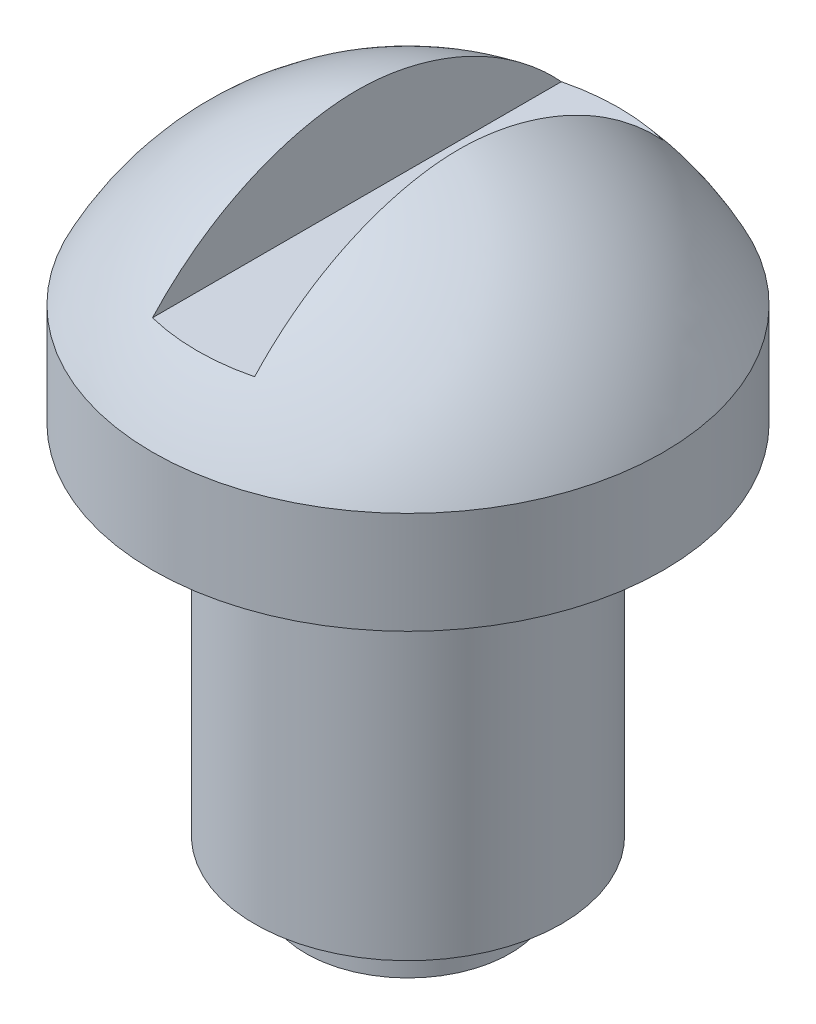
ISO-10303-21;
HEADER;
FILE_DESCRIPTION(('STEP AP214'),'2;1');
FILE_NAME('part.step','',(''),(''),'','','');
FILE_SCHEMA(('AUTOMOTIVE_DESIGN { 1 0 10303 214 1 1 1 1 }'));
ENDSEC;
DATA;
#1=APPLICATION_CONTEXT('core data for automotive mechanical design processes');
#2=APPLICATION_PROTOCOL_DEFINITION('international standard','automotive_design',2000,#1);
#3=PRODUCT_CONTEXT('',#1,'mechanical');
#4=PRODUCT('Part','Part','',(#3));
#5=PRODUCT_RELATED_PRODUCT_CATEGORY('part','',(#4));
#6=PRODUCT_DEFINITION_FORMATION('','',#4);
#7=PRODUCT_DEFINITION_CONTEXT('part definition',#1,'design');
#8=PRODUCT_DEFINITION('design','',#6,#7);
#9=PRODUCT_DEFINITION_SHAPE('','',#8);
#10=(LENGTH_UNIT() NAMED_UNIT(*) SI_UNIT(.MILLI.,.METRE.));
#11=(NAMED_UNIT(*) PLANE_ANGLE_UNIT() SI_UNIT($,.RADIAN.));
#12=(NAMED_UNIT(*) SI_UNIT($,.STERADIAN.) SOLID_ANGLE_UNIT());
#13=UNCERTAINTY_MEASURE_WITH_UNIT(LENGTH_MEASURE(1.E-05),#10,'distance_accuracy_value','');
#14=(GEOMETRIC_REPRESENTATION_CONTEXT(3) GLOBAL_UNCERTAINTY_ASSIGNED_CONTEXT((#13)) GLOBAL_UNIT_ASSIGNED_CONTEXT((#10,
#11,#12)) REPRESENTATION_CONTEXT('',''));
#15=CARTESIAN_POINT('',(0.,0.,0.));
#16=DIRECTION('',(0.,0.,1.));
#17=DIRECTION('',(1.,0.,0.));
#18=AXIS2_PLACEMENT_3D('',#15,#16,#17);
#19=CARTESIAN_POINT('',(0.,0.,0.));
#20=DIRECTION('',(0.,1.,0.));
#21=DIRECTION('',(-1.,0.,0.));
#22=AXIS2_PLACEMENT_3D('',#19,#20,#21);
#23=PLANE('',#22);
#24=CARTESIAN_POINT('',(0.,0.,0.));
#25=DIRECTION('',(0.,1.,0.));
#26=DIRECTION('',(-1.,0.,0.));
#27=AXIS2_PLACEMENT_3D('',#24,#25,#26);
#28=CIRCLE('',#27,2.);
#29=CARTESIAN_POINT('',(-2.,0.,0.));
#30=VERTEX_POINT('',#29);
#31=EDGE_CURVE('E76',#30,#30,#28,.T.);
#32=ORIENTED_EDGE('',*,*,#31,.F.);
#33=EDGE_LOOP('',(#32));
#34=FACE_BOUND('',#33,.T.);
#35=ADVANCED_FACE('F33',(#34),#23,.F.);
#36=CARTESIAN_POINT('',(0.,13.2834795938306,0.));
#37=DIRECTION('',(0.,1.,0.));
#38=DIRECTION('',(-1.,0.,0.));
#39=AXIS2_PLACEMENT_3D('',#36,#37,#38);
#40=CYLINDRICAL_SURFACE('',#39,2.);
#41=CARTESIAN_POINT('',(0.,1.,0.));
#42=DIRECTION('',(0.,1.,0.));
#43=DIRECTION('',(-1.,0.,0.));
#44=AXIS2_PLACEMENT_3D('',#41,#42,#43);
#45=CIRCLE('',#44,2.);
#46=CARTESIAN_POINT('',(-2.,1.,0.));
#47=VERTEX_POINT('',#46);
#48=EDGE_CURVE('E105',#47,#47,#45,.T.);
#49=ORIENTED_EDGE('',*,*,#48,.F.);
#50=EDGE_LOOP('',(#49));
#51=FACE_BOUND('',#50,.T.);
#52=ORIENTED_EDGE('',*,*,#31,.T.);
#53=EDGE_LOOP('',(#52));
#54=FACE_BOUND('',#53,.T.);
#55=ADVANCED_FACE('F95',(#51,#54),#40,.T.);
#56=CARTESIAN_POINT('',(2.,1.,0.));
#57=DIRECTION('',(0.,1.,0.));
#58=DIRECTION('',(-1.,0.,0.));
#59=AXIS2_PLACEMENT_3D('',#56,#57,#58);
#60=PLANE('',#59);
#61=CARTESIAN_POINT('',(0.,1.,0.));
#62=DIRECTION('',(0.,1.,0.));
#63=DIRECTION('',(-1.,0.,0.));
#64=AXIS2_PLACEMENT_3D('',#61,#62,#63);
#65=CIRCLE('',#64,3.);
#66=CARTESIAN_POINT('',(-3.,1.,0.));
#67=VERTEX_POINT('',#66);
#68=EDGE_CURVE('E107',#67,#67,#65,.T.);
#69=ORIENTED_EDGE('',*,*,#68,.F.);
#70=EDGE_LOOP('',(#69));
#71=FACE_BOUND('',#70,.T.);
#72=ORIENTED_EDGE('',*,*,#48,.T.);
#73=EDGE_LOOP('',(#72));
#74=FACE_BOUND('',#73,.T.);
#75=ADVANCED_FACE('F100',(#71,#74),#60,.F.);
#76=CARTESIAN_POINT('',(0.,13.2834795938306,0.));
#77=DIRECTION('',(0.,1.,0.));
#78=DIRECTION('',(-1.,0.,0.));
#79=AXIS2_PLACEMENT_3D('',#76,#77,#78);
#80=CYLINDRICAL_SURFACE('',#79,3.);
#81=CARTESIAN_POINT('',(0.,8.,0.));
#82=DIRECTION('',(0.,1.,0.));
#83=DIRECTION('',(-1.,0.,0.));
#84=AXIS2_PLACEMENT_3D('',#81,#82,#83);
#85=CIRCLE('',#84,3.);
#86=CARTESIAN_POINT('',(-3.,8.,0.));
#87=VERTEX_POINT('',#86);
#88=EDGE_CURVE('E112',#87,#87,#85,.T.);
#89=ORIENTED_EDGE('',*,*,#88,.F.);
#90=EDGE_LOOP('',(#89));
#91=FACE_BOUND('',#90,.T.);
#92=ORIENTED_EDGE('',*,*,#68,.T.);
#93=EDGE_LOOP('',(#92));
#94=FACE_BOUND('',#93,.T.);
#95=ADVANCED_FACE('F129',(#91,#94),#80,.T.);
#96=CARTESIAN_POINT('',(3.,8.,0.));
#97=DIRECTION('',(0.,1.,0.));
#98=DIRECTION('',(-1.,0.,0.));
#99=AXIS2_PLACEMENT_3D('',#96,#97,#98);
#100=PLANE('',#99);
#101=CARTESIAN_POINT('',(0.,8.,0.));
#102=DIRECTION('',(0.,1.,0.));
#103=DIRECTION('',(-1.,0.,0.));
#104=AXIS2_PLACEMENT_3D('',#101,#102,#103);
#105=CIRCLE('',#104,5.);
#106=CARTESIAN_POINT('',(-5.,8.,0.));
#107=VERTEX_POINT('',#106);
#108=EDGE_CURVE('E115',#107,#107,#105,.T.);
#109=ORIENTED_EDGE('',*,*,#108,.F.);
#110=EDGE_LOOP('',(#109));
#111=FACE_BOUND('',#110,.T.);
#112=ORIENTED_EDGE('',*,*,#88,.T.);
#113=EDGE_LOOP('',(#112));
#114=FACE_BOUND('',#113,.T.);
#115=ADVANCED_FACE('F124',(#111,#114),#100,.F.);
#116=CARTESIAN_POINT('',(0.,13.2834795938306,0.));
#117=DIRECTION('',(0.,1.,0.));
#118=DIRECTION('',(-1.,0.,0.));
#119=AXIS2_PLACEMENT_3D('',#116,#117,#118);
#120=CYLINDRICAL_SURFACE('',#119,5.);
#121=CARTESIAN_POINT('',(0.,10.,0.));
#122=DIRECTION('',(0.,1.,0.));
#123=DIRECTION('',(-1.,0.,0.));
#124=AXIS2_PLACEMENT_3D('',#121,#122,#123);
#125=CIRCLE('',#124,5.);
#126=CARTESIAN_POINT('',(-5.,10.,0.));
#127=VERTEX_POINT('',#126);
#128=EDGE_CURVE('E72',#127,#127,#125,.T.);
#129=ORIENTED_EDGE('',*,*,#128,.F.);
#130=EDGE_LOOP('',(#129));
#131=FACE_BOUND('',#130,.T.);
#132=ORIENTED_EDGE('',*,*,#108,.T.);
#133=EDGE_LOOP('',(#132));
#134=FACE_BOUND('',#133,.T.);
#135=ADVANCED_FACE('F93',(#131,#134),#120,.T.);
#136=CARTESIAN_POINT('',(0.,7.29399938463264,0.));
#137=DIRECTION('',(0.,1.,0.));
#138=DIRECTION('',(-1.,0.,0.));
#139=AXIS2_PLACEMENT_3D('',#136,#137,#138);
#140=DEGENERATE_TOROIDAL_SURFACE('',#139,0.355143384600591,6.,.F.);
#141=CARTESIAN_POINT('',(1.,13.1389618658786,0.));
#142=CARTESIAN_POINT('',(1.,13.1389603919835,0.0850328425565637));
#143=CARTESIAN_POINT('',(1.,13.1364344246599,0.170070660451229));
#144=CARTESIAN_POINT('',(1.,13.1264695741514,0.339867655967292));
#145=CARTESIAN_POINT('',(1.,13.1190296841498,0.424626772908076));
#146=CARTESIAN_POINT('',(1.,13.0995356908146,0.593773379398525));
#147=CARTESIAN_POINT('',(1.,13.087472811866,0.678159851505433));
#148=CARTESIAN_POINT('',(1.,13.0590506359627,0.846205859484286));
#149=CARTESIAN_POINT('',(1.,13.0426907916764,0.929865301346359));
#150=CARTESIAN_POINT('',(1.,12.9907346277812,1.16507832985906));
#151=CARTESIAN_POINT('',(1.,12.9504130760353,1.31561409344176));
#152=CARTESIAN_POINT('',(1.,12.8573184172411,1.61277558515722));
#153=CARTESIAN_POINT('',(1.,12.8045399922619,1.75939961350334));
#154=CARTESIAN_POINT('',(1.,12.6284124182625,2.19227184737322));
#155=CARTESIAN_POINT('',(1.,12.4872740009543,2.47150689425713));
#156=CARTESIAN_POINT('',(1.,12.159427444758,3.00854414756779));
#157=CARTESIAN_POINT('',(1.,11.9719430926804,3.26586877813439));
#158=CARTESIAN_POINT('',(1.,11.5579922369121,3.74683266680831));
#159=CARTESIAN_POINT('',(1.,11.3315404059199,3.97048454473703));
#160=CARTESIAN_POINT('',(1.,10.8358623499102,4.38661861875134));
#161=CARTESIAN_POINT('',(1.,10.5652878411453,4.57749691876385));
#162=CARTESIAN_POINT('',(1.,9.99599766263568,4.91141635871516));
#163=CARTESIAN_POINT('',(1.,9.69727470078855,5.05444505888901));
#164=CARTESIAN_POINT('',(1.,9.07865799600566,5.2891840472589));
#165=CARTESIAN_POINT('',(1.,8.75866978276463,5.38064547974962));
#166=CARTESIAN_POINT('',(1.,8.10791277321656,5.50860683714735));
#167=CARTESIAN_POINT('',(1.,7.77714471936667,5.54511053910701));
#168=CARTESIAN_POINT('',(1.,7.11380400338354,5.56215193085177));
#169=CARTESIAN_POINT('',(1.,6.78122975667972,5.54262802786194));
#170=CARTESIAN_POINT('',(1.,6.12404465851391,5.44802697595133));
#171=CARTESIAN_POINT('',(1.,5.79943460785946,5.37294426399918));
#172=CARTESIAN_POINT('',(1.,5.16737468168114,5.1693183789964));
#173=CARTESIAN_POINT('',(1.,4.85992779016648,5.04076594225955));
#174=CARTESIAN_POINT('',(1.,4.27108573493106,4.73387108362165));
#175=CARTESIAN_POINT('',(1.,3.98968356254225,4.55554210883003));
#176=CARTESIAN_POINT('',(1.,3.46112918902706,4.15428608792663));
#177=CARTESIAN_POINT('',(1.,3.21394331949111,3.9314034177033));
#178=CARTESIAN_POINT('',(1.,2.76047791286786,3.44707038672561));
#179=CARTESIAN_POINT('',(1.,2.55422754858956,3.18559275090249));
#180=CARTESIAN_POINT('',(1.,2.1894726993251,2.63214183958189));
#181=CARTESIAN_POINT('',(1.,2.03082144103085,2.34026612711448));
#182=CARTESIAN_POINT('',(1.,1.83230109435047,1.8856908368542));
#183=CARTESIAN_POINT('',(1.,1.77269561312684,1.73133895856993));
#184=CARTESIAN_POINT('',(1.,1.66732944982305,1.41800863715458));
#185=CARTESIAN_POINT('',(1.,1.62156043400984,1.2590330424092));
#186=CARTESIAN_POINT('',(1.,1.55271793148878,0.97015369465858));
#187=CARTESIAN_POINT('',(1.,1.5269241406722,0.840892765526842));
#188=CARTESIAN_POINT('',(1.,1.4857282674408,0.58074918979322));
#189=CARTESIAN_POINT('',(1.,1.47032142747817,0.449867313649059));
#190=CARTESIAN_POINT('',(1.,1.45117033213037,0.187464266725036));
#191=CARTESIAN_POINT('',(1.,1.44740489724965,0.0559446934391722));
#192=CARTESIAN_POINT('',(1.,1.4519891912672,-0.206893805210199));
#193=CARTESIAN_POINT('',(1.,1.46034067683506,-0.338212698716693));
#194=CARTESIAN_POINT('',(1.,1.48810939798059,-0.599163943765945));
#195=CARTESIAN_POINT('',(1.,1.50748683125071,-0.728800655445434));
#196=CARTESIAN_POINT('',(1.,1.5561212707663,-0.986202867987158));
#197=CARTESIAN_POINT('',(1.,1.58537966971374,-1.11396810241833));
#198=CARTESIAN_POINT('',(1.,1.65312354708426,-1.36737350224881));
#199=CARTESIAN_POINT('',(1.,1.6916322411765,-1.49300745556586));
#200=CARTESIAN_POINT('',(1.,1.77732126189906,-1.74123809249285));
#201=CARTESIAN_POINT('',(1.,1.82450114085274,-1.86383493253249));
#202=CARTESIAN_POINT('',(1.,1.99243147634959,-2.25908094925751));
#203=CARTESIAN_POINT('',(1.,2.13053184924552,-2.52460098745995));
#204=CARTESIAN_POINT('',(1.,2.44536340466876,-3.03104874238679));
#205=CARTESIAN_POINT('',(1.,2.6220581944685,-3.27199931509947));
#206=CARTESIAN_POINT('',(1.,3.02904381970867,-3.74660836934393));
#207=CARTESIAN_POINT('',(1.,3.26289129213469,-3.97723468013999));
#208=CARTESIAN_POINT('',(1.,3.76574235644802,-4.39660845475862));
#209=CARTESIAN_POINT('',(1.,4.03477033071908,-4.58532662646686));
#210=CARTESIAN_POINT('',(1.,4.60354948807616,-4.91739742845414));
#211=CARTESIAN_POINT('',(1.,4.9036086604776,-5.06022303173989));
#212=CARTESIAN_POINT('',(1.,5.52335617016387,-5.29357187265148));
#213=CARTESIAN_POINT('',(1.,5.8430414863261,-5.38410313791064));
#214=CARTESIAN_POINT('',(1.,6.49381637470259,-5.51051170896944));
#215=CARTESIAN_POINT('',(1.,6.82493072479348,-5.54626150446674));
#216=CARTESIAN_POINT('',(1.,7.48847275019264,-5.56169447174759));
#217=CARTESIAN_POINT('',(1.,7.82090046723166,-5.54137584747924));
#218=CARTESIAN_POINT('',(1.,8.47777884413847,-5.445220666461));
#219=CARTESIAN_POINT('',(1.,8.80222590359157,-5.36935951026516));
#220=CARTESIAN_POINT('',(1.,9.43379618967364,-5.16422276508375));
#221=CARTESIAN_POINT('',(1.,9.74091825660864,-5.03494360523394));
#222=CARTESIAN_POINT('',(1.,10.3290191795942,-4.72665039340705));
#223=CARTESIAN_POINT('',(1.,10.6100028716363,-4.5476455659519));
#224=CARTESIAN_POINT('',(1.,11.1377998747752,-4.14497018018803));
#225=CARTESIAN_POINT('',(1.,11.3846228494897,-3.92131229755071));
#226=CARTESIAN_POINT('',(1.,11.8365894661061,-3.43613582912001));
#227=CARTESIAN_POINT('',(1.,12.0418144306335,-3.1746928608352));
#228=CARTESIAN_POINT('',(1.,12.4054008914517,-2.62035407646978));
#229=CARTESIAN_POINT('',(1.,12.5637135254302,-2.3274258960404));
#230=CARTESIAN_POINT('',(1.,12.7526571763881,-1.89165831000316));
#231=CARTESIAN_POINT('',(1.,12.8048097914375,-1.75781482121982));
#232=CARTESIAN_POINT('',(1.,12.89876610149,-1.48646197326711));
#233=CARTESIAN_POINT('',(1.,12.9405676445138,-1.34895185838021));
#234=CARTESIAN_POINT('',(1.,13.0130135265239,-1.0715118452414));
#235=CARTESIAN_POINT('',(1.,13.0436942611277,-0.931591439565383));
#236=CARTESIAN_POINT('',(1.,13.093031749279,-0.649702165294844));
#237=CARTESIAN_POINT('',(1.,13.1116987632068,-0.507735150861897));
#238=CARTESIAN_POINT('',(1.,13.1286796408662,-0.304492896103027));
#239=CARTESIAN_POINT('',(1.,13.1325261992823,-0.243650762732366));
#240=CARTESIAN_POINT('',(1.,13.1376674684358,-0.121873249758503));
#241=CARTESIAN_POINT('',(1.,13.1389629221302,-0.0609379024772165));
#242=CARTESIAN_POINT('',(1.,13.1389618658786,0.));
#243=B_SPLINE_CURVE_WITH_KNOTS('',3,(#141,#142,#143,#144,#145,#146,#147,#148,#149,#150,#151,
#152,#153,#154,#155,#156,#157,#158,#159,#160,#161,#162,#163,#164,#165,#166,#167,#168,#169,#170,
#171,#172,#173,#174,#175,#176,#177,#178,#179,#180,#181,#182,#183,#184,#185,#186,#187,#188,#189,
#190,#191,#192,#193,#194,#195,#196,#197,#198,#199,#200,#201,#202,#203,#204,#205,#206,#207,#208,
#209,#210,#211,#212,#213,#214,#215,#216,#217,#218,#219,#220,#221,#222,#223,#224,#225,#226,#227,
#228,#229,#230,#231,#232,#233,#234,#235,#236,#237,#238,#239,#240,#241,#242),.UNSPECIFIED.,.T.,
.F.,(4,2,2,2,2,2,2,2,2,2,2,2,2,2,2,2,2,2,2,2,2,2,2,2,2,2,2,2,2,2,2,2,2,2,2,2,2,2,2,2,2,2,2,2,2,
2,2,2,2,2,4),(0.,0.255071021588062,0.510194321054442,0.76580432793682,1.02144690928111,
1.48832134712622,1.95539545877336,2.88958413841847,3.84062714488441,4.79131282891856,
5.78001171242867,6.76896743489489,7.76265572882096,8.7562757269068,9.75098845864987,
10.7458008031664,11.7407855718084,12.7355018054777,13.7292321853782,14.7236682272114,
15.7150056121808,16.2108764320282,16.7064479900263,17.1015138495826,17.496398633478,
17.890564569703,18.2847876564645,18.6775965938879,19.0704609200538,19.4643217217308,
19.8581621948389,20.7520803656567,21.6451592247433,22.6258164179018,23.6071569087712,
24.599394586521,25.591479906696,26.5858709330101,27.5802938132383,28.57515738387,
29.570087469485,30.564833110467,31.5592967732864,32.5517971348978,33.5453276471172,
33.9759464214681,34.4066546460911,34.8359402644389,35.2648587609327,35.4477060148284,
35.6305000103127),.UNSPECIFIED.);
#244=CARTESIAN_POINT('',(1.,11.2834795938306,-4.00337458275441));
#245=VERTEX_POINT('',#244);
#246=CARTESIAN_POINT('',(1.,11.2834795938306,4.00337458275441));
#247=VERTEX_POINT('',#246);
#248=EDGE_CURVE('E70',#245,#247,#243,.T.);
#249=ORIENTED_EDGE('',*,*,#248,.T.);
#250=CARTESIAN_POINT('',(0.,11.2834795938306,0.));
#251=DIRECTION('',(0.,-1.,0.));
#252=DIRECTION('',(0.,0.,-1.));
#253=AXIS2_PLACEMENT_3D('',#250,#251,#252);
#254=CIRCLE('',#253,4.12637953293732);
#255=CARTESIAN_POINT('',(-1.,11.2834795938306,4.00337458275441));
#256=VERTEX_POINT('',#255);
#257=EDGE_CURVE('E11',#247,#256,#254,.T.);
#258=ORIENTED_EDGE('',*,*,#257,.T.);
#259=CARTESIAN_POINT('',(-1.,13.1389618658786,0.));
#260=CARTESIAN_POINT('',(-1.,13.1389603919835,-0.0850328425565638));
#261=CARTESIAN_POINT('',(-1.,13.1364344246599,-0.170070660451229));
#262=CARTESIAN_POINT('',(-1.,13.1264695741514,-0.339867655967292));
#263=CARTESIAN_POINT('',(-1.,13.1190296841498,-0.424626772908076));
#264=CARTESIAN_POINT('',(-1.,13.0995356908146,-0.593773379398526));
#265=CARTESIAN_POINT('',(-1.,13.087472811866,-0.678159851505434));
#266=CARTESIAN_POINT('',(-1.,13.0590506359627,-0.846205859484287));
#267=CARTESIAN_POINT('',(-1.,13.0426907916764,-0.92986530134636));
#268=CARTESIAN_POINT('',(-1.,12.9907346277812,-1.16507832985906));
#269=CARTESIAN_POINT('',(-1.,12.9504130760353,-1.31561409344176));
#270=CARTESIAN_POINT('',(-1.,12.8573184172411,-1.61277558515722));
#271=CARTESIAN_POINT('',(-1.,12.8045399922619,-1.75939961350334));
#272=CARTESIAN_POINT('',(-1.,12.6284124182625,-2.19227184737322));
#273=CARTESIAN_POINT('',(-1.,12.4872740009543,-2.47150689425713));
#274=CARTESIAN_POINT('',(-1.,12.159427444758,-3.00854414756779));
#275=CARTESIAN_POINT('',(-1.,11.9719430926804,-3.26586877813439));
#276=CARTESIAN_POINT('',(-1.,11.5579922369121,-3.74683266680831));
#277=CARTESIAN_POINT('',(-1.,11.3315404059199,-3.97048454473703));
#278=CARTESIAN_POINT('',(-1.,10.8358623499102,-4.38661861875134));
#279=CARTESIAN_POINT('',(-1.,10.5652878411453,-4.57749691876385));
#280=CARTESIAN_POINT('',(-1.,9.99599766263568,-4.91141635871516));
#281=CARTESIAN_POINT('',(-1.,9.69727470078854,-5.05444505888901));
#282=CARTESIAN_POINT('',(-1.,9.07865799600566,-5.2891840472589));
#283=CARTESIAN_POINT('',(-1.,8.75866978276463,-5.38064547974962));
#284=CARTESIAN_POINT('',(-1.,8.10791277321656,-5.50860683714735));
#285=CARTESIAN_POINT('',(-1.,7.77714471936667,-5.54511053910701));
#286=CARTESIAN_POINT('',(-1.,7.11380400338354,-5.56215193085177));
#287=CARTESIAN_POINT('',(-1.,6.78122975667972,-5.54262802786194));
#288=CARTESIAN_POINT('',(-1.,6.12404465851391,-5.44802697595133));
#289=CARTESIAN_POINT('',(-1.,5.79943460785946,-5.37294426399918));
#290=CARTESIAN_POINT('',(-1.,5.16737468168114,-5.1693183789964));
#291=CARTESIAN_POINT('',(-1.,4.85992779016648,-5.04076594225955));
#292=CARTESIAN_POINT('',(-1.,4.27108573493106,-4.73387108362165));
#293=CARTESIAN_POINT('',(-1.,3.98968356254225,-4.55554210883003));
#294=CARTESIAN_POINT('',(-1.,3.46112918902706,-4.15428608792663));
#295=CARTESIAN_POINT('',(-1.,3.21394331949111,-3.9314034177033));
#296=CARTESIAN_POINT('',(-1.,2.76047791286786,-3.44707038672561));
#297=CARTESIAN_POINT('',(-1.,2.55422754858956,-3.18559275090249));
#298=CARTESIAN_POINT('',(-1.,2.1894726993251,-2.63214183958188));
#299=CARTESIAN_POINT('',(-1.,2.03082144103085,-2.34026612711448));
#300=CARTESIAN_POINT('',(-1.,1.83230109435047,-1.8856908368542));
#301=CARTESIAN_POINT('',(-1.,1.77269561312684,-1.73133895856993));
#302=CARTESIAN_POINT('',(-1.,1.66732944982305,-1.41800863715458));
#303=CARTESIAN_POINT('',(-1.,1.62156043400984,-1.2590330424092));
#304=CARTESIAN_POINT('',(-1.,1.55271793148878,-0.97015369465858));
#305=CARTESIAN_POINT('',(-1.,1.5269241406722,-0.840892765526841));
#306=CARTESIAN_POINT('',(-1.,1.4857282674408,-0.580749189793219));
#307=CARTESIAN_POINT('',(-1.,1.47032142747817,-0.449867313649058));
#308=CARTESIAN_POINT('',(-1.,1.45117033213037,-0.187464266725036));
#309=CARTESIAN_POINT('',(-1.,1.44740489724965,-0.0559446934391736));
#310=CARTESIAN_POINT('',(-1.,1.45198919126721,0.206893805210197));
#311=CARTESIAN_POINT('',(-1.,1.46034067683506,0.338212698716693));
#312=CARTESIAN_POINT('',(-1.,1.48810939798059,0.599163943765946));
#313=CARTESIAN_POINT('',(-1.,1.50748683125071,0.728800655445433));
#314=CARTESIAN_POINT('',(-1.,1.5561212707663,0.986202867987156));
#315=CARTESIAN_POINT('',(-1.,1.58537966971374,1.11396810241833));
#316=CARTESIAN_POINT('',(-1.,1.65312354708426,1.36737350224881));
#317=CARTESIAN_POINT('',(-1.,1.6916322411765,1.49300745556586));
#318=CARTESIAN_POINT('',(-1.,1.77732126189906,1.74123809249285));
#319=CARTESIAN_POINT('',(-1.,1.82450114085274,1.86383493253249));
#320=CARTESIAN_POINT('',(-1.,1.99243147634959,2.25908094925751));
#321=CARTESIAN_POINT('',(-1.,2.13053184924552,2.52460098745995));
#322=CARTESIAN_POINT('',(-1.,2.44536340466876,3.0310487423868));
#323=CARTESIAN_POINT('',(-1.,2.6220581944685,3.27199931509947));
#324=CARTESIAN_POINT('',(-1.,3.02904381970867,3.74660836934393));
#325=CARTESIAN_POINT('',(-1.,3.26289129213469,3.97723468013999));
#326=CARTESIAN_POINT('',(-1.,3.76574235644802,4.39660845475862));
#327=CARTESIAN_POINT('',(-1.,4.03477033071909,4.58532662646686));
#328=CARTESIAN_POINT('',(-1.,4.60354948807616,4.91739742845414));
#329=CARTESIAN_POINT('',(-1.,4.9036086604776,5.0602230317399));
#330=CARTESIAN_POINT('',(-1.,5.52335617016387,5.29357187265148));
#331=CARTESIAN_POINT('',(-1.,5.8430414863261,5.38410313791064));
#332=CARTESIAN_POINT('',(-1.,6.49381637470259,5.51051170896944));
#333=CARTESIAN_POINT('',(-1.,6.82493072479348,5.54626150446674));
#334=CARTESIAN_POINT('',(-1.,7.48847275019264,5.56169447174759));
#335=CARTESIAN_POINT('',(-1.,7.82090046723166,5.54137584747924));
#336=CARTESIAN_POINT('',(-1.,8.47777884413847,5.445220666461));
#337=CARTESIAN_POINT('',(-1.,8.80222590359157,5.36935951026516));
#338=CARTESIAN_POINT('',(-1.,9.43379618967364,5.16422276508375));
#339=CARTESIAN_POINT('',(-1.,9.74091825660864,5.03494360523394));
#340=CARTESIAN_POINT('',(-1.,10.3290191795942,4.72665039340705));
#341=CARTESIAN_POINT('',(-1.,10.6100028716363,4.5476455659519));
#342=CARTESIAN_POINT('',(-1.,11.1377998747752,4.14497018018803));
#343=CARTESIAN_POINT('',(-1.,11.3846228494897,3.92131229755071));
#344=CARTESIAN_POINT('',(-1.,11.8365894661061,3.43613582912001));
#345=CARTESIAN_POINT('',(-1.,12.0418144306335,3.1746928608352));
#346=CARTESIAN_POINT('',(-1.,12.4054008914517,2.62035407646978));
#347=CARTESIAN_POINT('',(-1.,12.5637135254302,2.3274258960404));
#348=CARTESIAN_POINT('',(-1.,12.7526571763881,1.89165831000316));
#349=CARTESIAN_POINT('',(-1.,12.8048097914375,1.75781482121982));
#350=CARTESIAN_POINT('',(-1.,12.89876610149,1.48646197326711));
#351=CARTESIAN_POINT('',(-1.,12.9405676445138,1.34895185838021));
#352=CARTESIAN_POINT('',(-1.,13.0130135265239,1.0715118452414));
#353=CARTESIAN_POINT('',(-1.,13.0436942611277,0.931591439565382));
#354=CARTESIAN_POINT('',(-1.,13.093031749279,0.649702165294843));
#355=CARTESIAN_POINT('',(-1.,13.1116987632068,0.507735150861896));
#356=CARTESIAN_POINT('',(-1.,13.1286796408662,0.304492896103025));
#357=CARTESIAN_POINT('',(-1.,13.1325261992823,0.243650762732361));
#358=CARTESIAN_POINT('',(-1.,13.1376674684358,0.121873249758498));
#359=CARTESIAN_POINT('',(-1.,13.1389629221302,0.0609379024772141));
#360=CARTESIAN_POINT('',(-1.,13.1389618658786,0.));
#361=B_SPLINE_CURVE_WITH_KNOTS('',3,(#259,#260,#261,#262,#263,#264,#265,#266,#267,#268,#269,
#270,#271,#272,#273,#274,#275,#276,#277,#278,#279,#280,#281,#282,#283,#284,#285,#286,#287,#288,
#289,#290,#291,#292,#293,#294,#295,#296,#297,#298,#299,#300,#301,#302,#303,#304,#305,#306,#307,
#308,#309,#310,#311,#312,#313,#314,#315,#316,#317,#318,#319,#320,#321,#322,#323,#324,#325,#326,
#327,#328,#329,#330,#331,#332,#333,#334,#335,#336,#337,#338,#339,#340,#341,#342,#343,#344,#345,
#346,#347,#348,#349,#350,#351,#352,#353,#354,#355,#356,#357,#358,#359,#360),.UNSPECIFIED.,.T.,
.F.,(4,2,2,2,2,2,2,2,2,2,2,2,2,2,2,2,2,2,2,2,2,2,2,2,2,2,2,2,2,2,2,2,2,2,2,2,2,2,2,2,2,2,2,2,2,
2,2,2,2,2,4),(0.,0.255071021588062,0.510194321054443,0.765804327936821,1.02144690928111,
1.48832134712622,1.95539545877337,2.88958413841847,3.84062714488442,4.79131282891856,
5.78001171242867,6.76896743489489,7.76265572882096,8.7562757269068,9.75098845864987,
10.7458008031664,11.7407855718084,12.7355018054777,13.7292321853782,14.7236682272114,
15.7150056121808,16.2108764320282,16.7064479900263,17.1015138495826,17.496398633478,
17.890564569703,18.2847876564645,18.6775965938879,19.0704609200538,19.4643217217308,
19.8581621948389,20.7520803656567,21.6451592247433,22.6258164179018,23.6071569087712,
24.599394586521,25.591479906696,26.5858709330101,27.5802938132383,28.57515738387,
29.5700874694849,30.5648331104669,31.5592967732864,32.5517971348978,33.5453276471172,
33.9759464214681,34.4066546460911,34.8359402644389,35.2648587609327,35.4477060148284,
35.6305000103127),.UNSPECIFIED.);
#362=CARTESIAN_POINT('',(-1.,11.2834795938306,-4.00337458275441));
#363=VERTEX_POINT('',#362);
#364=EDGE_CURVE('E36',#256,#363,#361,.T.);
#365=ORIENTED_EDGE('',*,*,#364,.T.);
#366=EDGE_CURVE('E46',#363,#245,#254,.T.);
#367=ORIENTED_EDGE('',*,*,#366,.T.);
#368=EDGE_LOOP('',(#249,#258,#365,#367));
#369=FACE_BOUND('',#368,.T.);
#370=ORIENTED_EDGE('',*,*,#128,.T.);
#371=EDGE_LOOP('',(#370));
#372=FACE_BOUND('',#371,.T.);
#373=ADVANCED_FACE('F74',(#369,#372),#140,.F.);
#374=CARTESIAN_POINT('',(-1.,11.2834795938306,-5.));
#375=DIRECTION('',(-1.,0.,0.));
#376=DIRECTION('',(0.,-1.,0.));
#377=AXIS2_PLACEMENT_3D('',#374,#375,#376);
#378=PLANE('',#377);
#379=DIRECTION('',(0.,0.,1.));
#380=VECTOR('',#379,1.);
#381=CARTESIAN_POINT('',(-1.,11.2834795938306,-5.));
#382=LINE('',#381,#380);
#383=EDGE_CURVE('E65',#363,#256,#382,.T.);
#384=ORIENTED_EDGE('',*,*,#383,.F.);
#385=ORIENTED_EDGE('',*,*,#364,.F.);
#386=EDGE_LOOP('',(#384,#385));
#387=FACE_BOUND('',#386,.T.);
#388=ADVANCED_FACE('F86',(#387),#378,.F.);
#389=CARTESIAN_POINT('',(1.,11.2834795938306,-5.));
#390=DIRECTION('',(1.,0.,0.));
#391=DIRECTION('',(0.,0.,-1.));
#392=AXIS2_PLACEMENT_3D('',#389,#390,#391);
#393=PLANE('',#392);
#394=DIRECTION('',(0.,0.,1.));
#395=VECTOR('',#394,1.);
#396=CARTESIAN_POINT('',(1.,11.2834795938306,-5.));
#397=LINE('',#396,#395);
#398=EDGE_CURVE('E53',#245,#247,#397,.T.);
#399=ORIENTED_EDGE('',*,*,#398,.T.);
#400=ORIENTED_EDGE('',*,*,#248,.F.);
#401=EDGE_LOOP('',(#399,#400));
#402=FACE_BOUND('',#401,.T.);
#403=ADVANCED_FACE('F69',(#402),#393,.F.);
#404=CARTESIAN_POINT('',(1.,11.2834795938306,-5.));
#405=DIRECTION('',(0.,-1.,0.));
#406=DIRECTION('',(0.,0.,-1.));
#407=AXIS2_PLACEMENT_3D('',#404,#405,#406);
#408=PLANE('',#407);
#409=ORIENTED_EDGE('',*,*,#398,.F.);
#410=ORIENTED_EDGE('',*,*,#366,.F.);
#411=ORIENTED_EDGE('',*,*,#383,.T.);
#412=ORIENTED_EDGE('',*,*,#257,.F.);
#413=EDGE_LOOP('',(#409,#410,#411,#412));
#414=FACE_BOUND('',#413,.T.);
#415=ADVANCED_FACE('F64',(#414),#408,.F.);
#416=CLOSED_SHELL('',(#35,#55,#75,#95,#115,#135,#373,#388,#403,#415));
#417=MANIFOLD_SOLID_BREP('B2',#416);
#418=ADVANCED_BREP_SHAPE_REPRESENTATION('',(#18,#417),#14);
#419=SHAPE_DEFINITION_REPRESENTATION(#9,#418);
ENDSEC;
END-ISO-10303-21;
